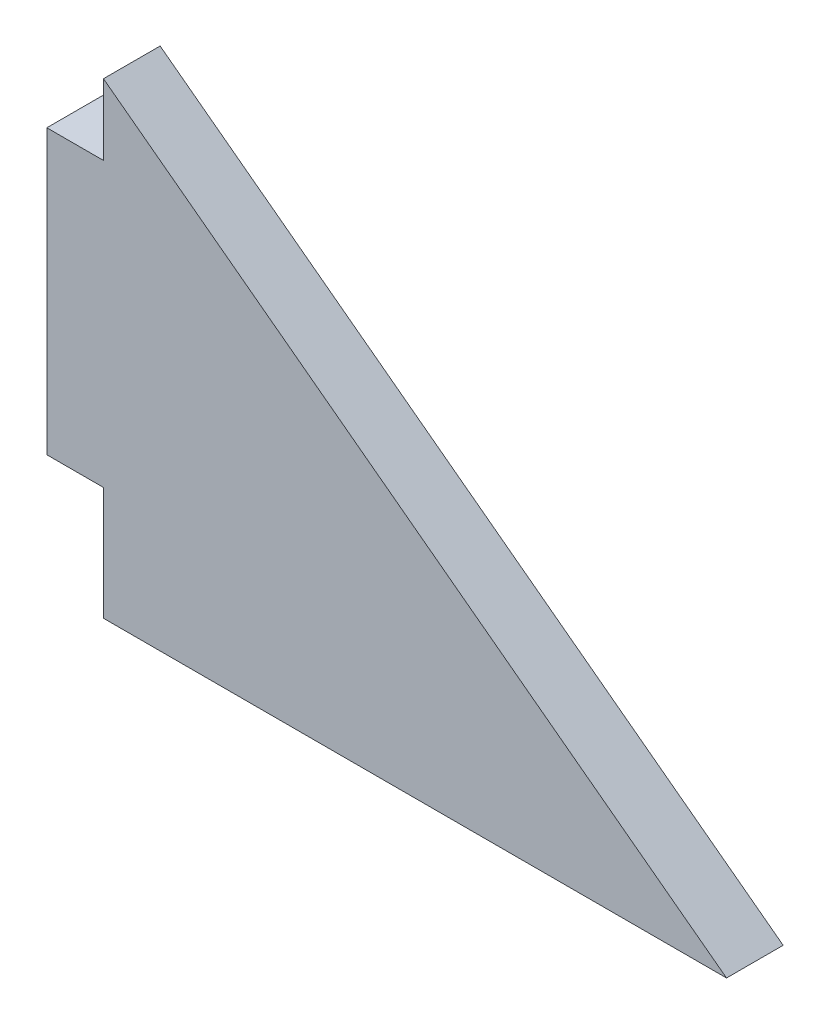
ISO-10303-21;
HEADER;
FILE_DESCRIPTION(('STEP AP214'),'2;1');
FILE_NAME('part.step','',(''),(''),'','','');
FILE_SCHEMA(('AUTOMOTIVE_DESIGN { 1 0 10303 214 1 1 1 1 }'));
ENDSEC;
DATA;
#1=APPLICATION_CONTEXT('core data for automotive mechanical design processes');
#2=APPLICATION_PROTOCOL_DEFINITION('international standard','automotive_design',2000,#1);
#3=PRODUCT_CONTEXT('',#1,'mechanical');
#4=PRODUCT('Part','Part','',(#3));
#5=PRODUCT_RELATED_PRODUCT_CATEGORY('part','',(#4));
#6=PRODUCT_DEFINITION_FORMATION('','',#4);
#7=PRODUCT_DEFINITION_CONTEXT('part definition',#1,'design');
#8=PRODUCT_DEFINITION('design','',#6,#7);
#9=PRODUCT_DEFINITION_SHAPE('','',#8);
#10=(LENGTH_UNIT() NAMED_UNIT(*) SI_UNIT(.MILLI.,.METRE.));
#11=(NAMED_UNIT(*) PLANE_ANGLE_UNIT() SI_UNIT($,.RADIAN.));
#12=(NAMED_UNIT(*) SI_UNIT($,.STERADIAN.) SOLID_ANGLE_UNIT());
#13=UNCERTAINTY_MEASURE_WITH_UNIT(LENGTH_MEASURE(1.E-05),#10,'distance_accuracy_value','');
#14=(GEOMETRIC_REPRESENTATION_CONTEXT(3) GLOBAL_UNCERTAINTY_ASSIGNED_CONTEXT((#13)) GLOBAL_UNIT_ASSIGNED_CONTEXT((#10,
#11,#12)) REPRESENTATION_CONTEXT('',''));
#15=CARTESIAN_POINT('',(0.,0.,0.));
#16=DIRECTION('',(0.,0.,1.));
#17=DIRECTION('',(1.,0.,0.));
#18=AXIS2_PLACEMENT_3D('',#15,#16,#17);
#19=CARTESIAN_POINT('',(2.,0.,2.));
#20=DIRECTION('',(0.,1.,0.));
#21=DIRECTION('',(0.,0.,1.));
#22=AXIS2_PLACEMENT_3D('',#19,#20,#21);
#23=PLANE('',#22);
#24=DIRECTION('',(1.,0.,0.));
#25=VECTOR('',#24,1.);
#26=CARTESIAN_POINT('',(2.,0.,0.));
#27=LINE('',#26,#25);
#28=CARTESIAN_POINT('',(0.,0.,0.));
#29=VERTEX_POINT('',#28);
#30=CARTESIAN_POINT('',(2.,0.,0.));
#31=VERTEX_POINT('',#30);
#32=EDGE_CURVE('E134',#29,#31,#27,.T.);
#33=ORIENTED_EDGE('',*,*,#32,.T.);
#34=DIRECTION('',(0.,0.,-1.));
#35=VECTOR('',#34,1.);
#36=CARTESIAN_POINT('',(2.,0.,2.));
#37=LINE('',#36,#35);
#38=CARTESIAN_POINT('',(2.,0.,2.));
#39=VERTEX_POINT('',#38);
#40=EDGE_CURVE('E11',#39,#31,#37,.T.);
#41=ORIENTED_EDGE('',*,*,#40,.F.);
#42=DIRECTION('',(1.,0.,0.));
#43=VECTOR('',#42,1.);
#44=CARTESIAN_POINT('',(2.,0.,2.));
#45=LINE('',#44,#43);
#46=CARTESIAN_POINT('',(0.,0.,2.));
#47=VERTEX_POINT('',#46);
#48=EDGE_CURVE('E153',#47,#39,#45,.T.);
#49=ORIENTED_EDGE('',*,*,#48,.F.);
#50=DIRECTION('',(0.,0.,-1.));
#51=VECTOR('',#50,1.);
#52=CARTESIAN_POINT('',(0.,0.,2.));
#53=LINE('',#52,#51);
#54=EDGE_CURVE('E130',#47,#29,#53,.T.);
#55=ORIENTED_EDGE('',*,*,#54,.T.);
#56=EDGE_LOOP('',(#33,#41,#49,#55));
#57=FACE_BOUND('',#56,.T.);
#58=ADVANCED_FACE('F39',(#57),#23,.F.);
#59=CARTESIAN_POINT('',(2.,-4.,2.));
#60=DIRECTION('',(1.,0.,0.));
#61=DIRECTION('',(0.,0.,-1.));
#62=AXIS2_PLACEMENT_3D('',#59,#60,#61);
#63=PLANE('',#62);
#64=DIRECTION('',(0.,-1.,0.));
#65=VECTOR('',#64,1.);
#66=CARTESIAN_POINT('',(2.,-4.,0.));
#67=LINE('',#66,#65);
#68=CARTESIAN_POINT('',(2.,-4.,0.));
#69=VERTEX_POINT('',#68);
#70=EDGE_CURVE('E138',#31,#69,#67,.T.);
#71=ORIENTED_EDGE('',*,*,#70,.T.);
#72=DIRECTION('',(0.,0.,-1.));
#73=VECTOR('',#72,1.);
#74=CARTESIAN_POINT('',(2.,-4.,2.));
#75=LINE('',#74,#73);
#76=CARTESIAN_POINT('',(2.,-4.,2.));
#77=VERTEX_POINT('',#76);
#78=EDGE_CURVE('E48',#77,#69,#75,.T.);
#79=ORIENTED_EDGE('',*,*,#78,.F.);
#80=DIRECTION('',(0.,-1.,0.));
#81=VECTOR('',#80,1.);
#82=CARTESIAN_POINT('',(2.,-4.,2.));
#83=LINE('',#82,#81);
#84=EDGE_CURVE('E96',#39,#77,#83,.T.);
#85=ORIENTED_EDGE('',*,*,#84,.F.);
#86=ORIENTED_EDGE('',*,*,#40,.T.);
#87=EDGE_LOOP('',(#71,#79,#85,#86));
#88=FACE_BOUND('',#87,.T.);
#89=ADVANCED_FACE('F187',(#88),#63,.F.);
#90=CARTESIAN_POINT('',(24.,-4.,2.));
#91=DIRECTION('',(0.,1.,0.));
#92=DIRECTION('',(-1.,0.,0.));
#93=AXIS2_PLACEMENT_3D('',#90,#91,#92);
#94=PLANE('',#93);
#95=DIRECTION('',(1.,0.,0.));
#96=VECTOR('',#95,1.);
#97=CARTESIAN_POINT('',(24.,-4.,0.));
#98=LINE('',#97,#96);
#99=CARTESIAN_POINT('',(24.,-4.,0.));
#100=VERTEX_POINT('',#99);
#101=EDGE_CURVE('E141',#69,#100,#98,.T.);
#102=ORIENTED_EDGE('',*,*,#101,.T.);
#103=DIRECTION('',(0.,0.,-1.));
#104=VECTOR('',#103,1.);
#105=CARTESIAN_POINT('',(24.,-4.,2.));
#106=LINE('',#105,#104);
#107=CARTESIAN_POINT('',(24.,-4.,2.));
#108=VERTEX_POINT('',#107);
#109=EDGE_CURVE('E160',#108,#100,#106,.T.);
#110=ORIENTED_EDGE('',*,*,#109,.F.);
#111=DIRECTION('',(1.,0.,0.));
#112=VECTOR('',#111,1.);
#113=CARTESIAN_POINT('',(24.,-4.,2.));
#114=LINE('',#113,#112);
#115=EDGE_CURVE('E170',#77,#108,#114,.T.);
#116=ORIENTED_EDGE('',*,*,#115,.F.);
#117=ORIENTED_EDGE('',*,*,#78,.T.);
#118=EDGE_LOOP('',(#102,#110,#116,#117));
#119=FACE_BOUND('',#118,.T.);
#120=ADVANCED_FACE('F168',(#119),#94,.F.);
#121=CARTESIAN_POINT('',(2.,12.5,2.));
#122=DIRECTION('',(-0.6,-0.8,0.));
#123=DIRECTION('',(0.8,-0.6,0.));
#124=AXIS2_PLACEMENT_3D('',#121,#122,#123);
#125=PLANE('',#124);
#126=DIRECTION('',(-0.8,0.6,0.));
#127=VECTOR('',#126,1.);
#128=CARTESIAN_POINT('',(2.,12.5,0.));
#129=LINE('',#128,#127);
#130=CARTESIAN_POINT('',(2.,12.5,0.));
#131=VERTEX_POINT('',#130);
#132=EDGE_CURVE('E144',#100,#131,#129,.T.);
#133=ORIENTED_EDGE('',*,*,#132,.T.);
#134=DIRECTION('',(0.,0.,-1.));
#135=VECTOR('',#134,1.);
#136=CARTESIAN_POINT('',(2.,12.5,2.));
#137=LINE('',#136,#135);
#138=CARTESIAN_POINT('',(2.,12.5,2.));
#139=VERTEX_POINT('',#138);
#140=EDGE_CURVE('E123',#139,#131,#137,.T.);
#141=ORIENTED_EDGE('',*,*,#140,.F.);
#142=DIRECTION('',(-0.8,0.6,0.));
#143=VECTOR('',#142,1.);
#144=CARTESIAN_POINT('',(2.,12.5,2.));
#145=LINE('',#144,#143);
#146=EDGE_CURVE('E112',#108,#139,#145,.T.);
#147=ORIENTED_EDGE('',*,*,#146,.F.);
#148=ORIENTED_EDGE('',*,*,#109,.T.);
#149=EDGE_LOOP('',(#133,#141,#147,#148));
#150=FACE_BOUND('',#149,.T.);
#151=ADVANCED_FACE('F176',(#150),#125,.F.);
#152=CARTESIAN_POINT('',(2.,10.,2.));
#153=DIRECTION('',(1.,0.,0.));
#154=DIRECTION('',(0.,0.,-1.));
#155=AXIS2_PLACEMENT_3D('',#152,#153,#154);
#156=PLANE('',#155);
#157=DIRECTION('',(0.,-1.,0.));
#158=VECTOR('',#157,1.);
#159=CARTESIAN_POINT('',(2.,10.,0.));
#160=LINE('',#159,#158);
#161=CARTESIAN_POINT('',(2.,10.,0.));
#162=VERTEX_POINT('',#161);
#163=EDGE_CURVE('E121',#131,#162,#160,.T.);
#164=ORIENTED_EDGE('',*,*,#163,.T.);
#165=DIRECTION('',(0.,0.,-1.));
#166=VECTOR('',#165,1.);
#167=CARTESIAN_POINT('',(2.,10.,2.));
#168=LINE('',#167,#166);
#169=CARTESIAN_POINT('',(2.,10.,2.));
#170=VERTEX_POINT('',#169);
#171=EDGE_CURVE('E118',#170,#162,#168,.T.);
#172=ORIENTED_EDGE('',*,*,#171,.F.);
#173=DIRECTION('',(0.,-1.,0.));
#174=VECTOR('',#173,1.);
#175=CARTESIAN_POINT('',(2.,10.,2.));
#176=LINE('',#175,#174);
#177=EDGE_CURVE('E106',#139,#170,#176,.T.);
#178=ORIENTED_EDGE('',*,*,#177,.F.);
#179=ORIENTED_EDGE('',*,*,#140,.T.);
#180=EDGE_LOOP('',(#164,#172,#178,#179));
#181=FACE_BOUND('',#180,.T.);
#182=ADVANCED_FACE('F119',(#181),#156,.F.);
#183=CARTESIAN_POINT('',(0.,10.,2.));
#184=DIRECTION('',(0.,-1.,0.));
#185=DIRECTION('',(0.,0.,-1.));
#186=AXIS2_PLACEMENT_3D('',#183,#184,#185);
#187=PLANE('',#186);
#188=DIRECTION('',(-1.,0.,0.));
#189=VECTOR('',#188,1.);
#190=CARTESIAN_POINT('',(0.,10.,0.));
#191=LINE('',#190,#189);
#192=CARTESIAN_POINT('',(0.,10.,0.));
#193=VERTEX_POINT('',#192);
#194=EDGE_CURVE('E82',#162,#193,#191,.T.);
#195=ORIENTED_EDGE('',*,*,#194,.T.);
#196=DIRECTION('',(0.,0.,-1.));
#197=VECTOR('',#196,1.);
#198=CARTESIAN_POINT('',(0.,10.,2.));
#199=LINE('',#198,#197);
#200=CARTESIAN_POINT('',(0.,10.,2.));
#201=VERTEX_POINT('',#200);
#202=EDGE_CURVE('E124',#201,#193,#199,.T.);
#203=ORIENTED_EDGE('',*,*,#202,.F.);
#204=DIRECTION('',(-1.,0.,0.));
#205=VECTOR('',#204,1.);
#206=CARTESIAN_POINT('',(0.,10.,2.));
#207=LINE('',#206,#205);
#208=EDGE_CURVE('E110',#170,#201,#207,.T.);
#209=ORIENTED_EDGE('',*,*,#208,.F.);
#210=ORIENTED_EDGE('',*,*,#171,.T.);
#211=EDGE_LOOP('',(#195,#203,#209,#210));
#212=FACE_BOUND('',#211,.T.);
#213=ADVANCED_FACE('F126',(#212),#187,.F.);
#214=CARTESIAN_POINT('',(0.,0.,2.));
#215=DIRECTION('',(1.,0.,0.));
#216=DIRECTION('',(0.,0.,-1.));
#217=AXIS2_PLACEMENT_3D('',#214,#215,#216);
#218=PLANE('',#217);
#219=DIRECTION('',(0.,-1.,0.));
#220=VECTOR('',#219,1.);
#221=CARTESIAN_POINT('',(0.,0.,0.));
#222=LINE('',#221,#220);
#223=EDGE_CURVE('E88',#193,#29,#222,.T.);
#224=ORIENTED_EDGE('',*,*,#223,.T.);
#225=ORIENTED_EDGE('',*,*,#54,.F.);
#226=DIRECTION('',(0.,-1.,0.));
#227=VECTOR('',#226,1.);
#228=CARTESIAN_POINT('',(0.,0.,2.));
#229=LINE('',#228,#227);
#230=EDGE_CURVE('E56',#201,#47,#229,.T.);
#231=ORIENTED_EDGE('',*,*,#230,.F.);
#232=ORIENTED_EDGE('',*,*,#202,.T.);
#233=EDGE_LOOP('',(#224,#225,#231,#232));
#234=FACE_BOUND('',#233,.T.);
#235=ADVANCED_FACE('F201',(#234),#218,.F.);
#236=CARTESIAN_POINT('',(0.,0.,2.));
#237=DIRECTION('',(0.,0.,-1.));
#238=DIRECTION('',(-1.,0.,0.));
#239=AXIS2_PLACEMENT_3D('',#236,#237,#238);
#240=PLANE('',#239);
#241=ORIENTED_EDGE('',*,*,#48,.T.);
#242=ORIENTED_EDGE('',*,*,#84,.T.);
#243=ORIENTED_EDGE('',*,*,#115,.T.);
#244=ORIENTED_EDGE('',*,*,#146,.T.);
#245=ORIENTED_EDGE('',*,*,#177,.T.);
#246=ORIENTED_EDGE('',*,*,#208,.T.);
#247=ORIENTED_EDGE('',*,*,#230,.T.);
#248=EDGE_LOOP('',(#241,#242,#243,#244,#245,#246,#247));
#249=FACE_BOUND('',#248,.T.);
#250=ADVANCED_FACE('F108',(#249),#240,.F.);
#251=CARTESIAN_POINT('',(0.,0.,0.));
#252=DIRECTION('',(0.,0.,-1.));
#253=DIRECTION('',(-1.,0.,0.));
#254=AXIS2_PLACEMENT_3D('',#251,#252,#253);
#255=PLANE('',#254);
#256=ORIENTED_EDGE('',*,*,#32,.F.);
#257=ORIENTED_EDGE('',*,*,#223,.F.);
#258=ORIENTED_EDGE('',*,*,#194,.F.);
#259=ORIENTED_EDGE('',*,*,#163,.F.);
#260=ORIENTED_EDGE('',*,*,#132,.F.);
#261=ORIENTED_EDGE('',*,*,#101,.F.);
#262=ORIENTED_EDGE('',*,*,#70,.F.);
#263=EDGE_LOOP('',(#256,#257,#258,#259,#260,#261,#262));
#264=FACE_BOUND('',#263,.T.);
#265=ADVANCED_FACE('F174',(#264),#255,.T.);
#266=CLOSED_SHELL('',(#58,#89,#120,#151,#182,#213,#235,#250,#265));
#267=MANIFOLD_SOLID_BREP('B2',#266);
#268=ADVANCED_BREP_SHAPE_REPRESENTATION('',(#18,#267),#14);
#269=SHAPE_DEFINITION_REPRESENTATION(#9,#268);
ENDSEC;
END-ISO-10303-21;
